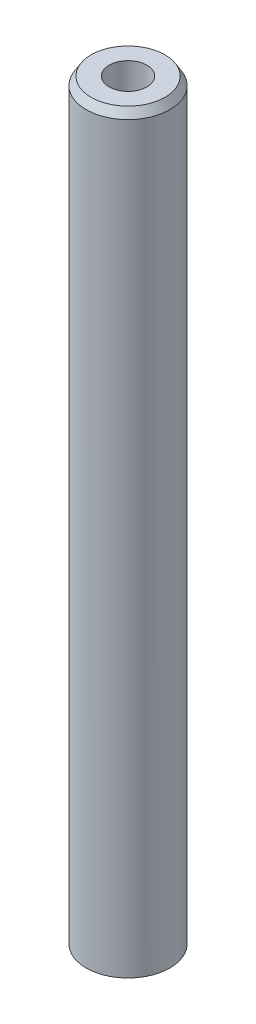
ISO-10303-21;
HEADER;
FILE_DESCRIPTION(('STEP AP214'),'2;1');
FILE_NAME('part.step','',(''),(''),'','','');
FILE_SCHEMA(('AUTOMOTIVE_DESIGN { 1 0 10303 214 1 1 1 1 }'));
ENDSEC;
DATA;
#1=APPLICATION_CONTEXT('core data for automotive mechanical design processes');
#2=APPLICATION_PROTOCOL_DEFINITION('international standard','automotive_design',2000,#1);
#3=PRODUCT_CONTEXT('',#1,'mechanical');
#4=PRODUCT('Part','Part','',(#3));
#5=PRODUCT_RELATED_PRODUCT_CATEGORY('part','',(#4));
#6=PRODUCT_DEFINITION_FORMATION('','',#4);
#7=PRODUCT_DEFINITION_CONTEXT('part definition',#1,'design');
#8=PRODUCT_DEFINITION('design','',#6,#7);
#9=PRODUCT_DEFINITION_SHAPE('','',#8);
#10=(LENGTH_UNIT() NAMED_UNIT(*) SI_UNIT(.MILLI.,.METRE.));
#11=(NAMED_UNIT(*) PLANE_ANGLE_UNIT() SI_UNIT($,.RADIAN.));
#12=(NAMED_UNIT(*) SI_UNIT($,.STERADIAN.) SOLID_ANGLE_UNIT());
#13=UNCERTAINTY_MEASURE_WITH_UNIT(LENGTH_MEASURE(1.E-05),#10,'distance_accuracy_value','');
#14=(GEOMETRIC_REPRESENTATION_CONTEXT(3) GLOBAL_UNCERTAINTY_ASSIGNED_CONTEXT((#13)) GLOBAL_UNIT_ASSIGNED_CONTEXT((#10,
#11,#12)) REPRESENTATION_CONTEXT('',''));
#15=CARTESIAN_POINT('',(0.,0.,0.));
#16=DIRECTION('',(0.,0.,1.));
#17=DIRECTION('',(1.,0.,0.));
#18=AXIS2_PLACEMENT_3D('',#15,#16,#17);
#19=CARTESIAN_POINT('',(0.,361.631506852674,0.));
#20=DIRECTION('',(0.,-1.,0.));
#21=DIRECTION('',(0.,0.,-1.));
#22=AXIS2_PLACEMENT_3D('',#19,#20,#21);
#23=CYLINDRICAL_SURFACE('',#22,20.);
#24=CARTESIAN_POINT('',(0.,357.716211464,0.));
#25=DIRECTION('',(0.,1.,0.));
#26=DIRECTION('',(0.,0.,1.));
#27=AXIS2_PLACEMENT_3D('',#24,#25,#26);
#28=CIRCLE('',#27,20.);
#29=CARTESIAN_POINT('',(0.,357.716211464,-20.));
#30=VERTEX_POINT('',#29);
#31=EDGE_CURVE('E50',#30,#30,#28,.F.);
#32=CARTESIAN_POINT('',(0.,2.37879637390487,0.));
#33=DIRECTION('',(0.,1.,0.));
#34=DIRECTION('',(0.,0.,1.));
#35=AXIS2_PLACEMENT_3D('',#32,#33,#34);
#36=CIRCLE('',#35,20.);
#37=CARTESIAN_POINT('',(0.,2.37879637390487,-20.));
#38=VERTEX_POINT('',#37);
#39=EDGE_CURVE('E51',#38,#38,#36,.T.);
#40=CARTESIAN_POINT('',(0.,357.716211464,-20.));
#41=CARTESIAN_POINT('',(0.,354.014780056811,-20.));
#42=CARTESIAN_POINT('',(0.,350.313348649623,-20.));
#43=CARTESIAN_POINT('',(0.,342.910485835246,-20.));
#44=CARTESIAN_POINT('',(0.,339.209054428058,-20.));
#45=CARTESIAN_POINT('',(0.,331.806191613681,-20.));
#46=CARTESIAN_POINT('',(0.,328.104760206492,-20.));
#47=CARTESIAN_POINT('',(0.,320.701897392115,-20.));
#48=CARTESIAN_POINT('',(0.,317.000465984927,-20.));
#49=CARTESIAN_POINT('',(0.,309.59760317055,-20.));
#50=CARTESIAN_POINT('',(0.,305.896171763361,-20.));
#51=CARTESIAN_POINT('',(0.,298.493308948984,-20.));
#52=CARTESIAN_POINT('',(0.,294.791877541796,-20.));
#53=CARTESIAN_POINT('',(0.,287.389014727419,-20.));
#54=CARTESIAN_POINT('',(0.,283.68758332023,-20.));
#55=CARTESIAN_POINT('',(0.,276.284720505853,-20.));
#56=CARTESIAN_POINT('',(0.,272.583289098665,-20.));
#57=CARTESIAN_POINT('',(0.,265.180426284288,-20.));
#58=CARTESIAN_POINT('',(0.,261.478994877099,-20.));
#59=CARTESIAN_POINT('',(0.,254.076132062722,-20.));
#60=CARTESIAN_POINT('',(0.,250.374700655534,-20.));
#61=CARTESIAN_POINT('',(0.,242.971837841157,-20.));
#62=CARTESIAN_POINT('',(0.,239.270406433968,-20.));
#63=CARTESIAN_POINT('',(0.,231.867543619591,-20.));
#64=CARTESIAN_POINT('',(0.,228.166112212403,-20.));
#65=CARTESIAN_POINT('',(0.,220.763249398026,-20.));
#66=CARTESIAN_POINT('',(0.,217.061817990837,-20.));
#67=CARTESIAN_POINT('',(0.,209.65895517646,-20.));
#68=CARTESIAN_POINT('',(0.,205.957523769272,-20.));
#69=CARTESIAN_POINT('',(0.,198.554660954895,-20.));
#70=CARTESIAN_POINT('',(0.,194.853229547706,-20.));
#71=CARTESIAN_POINT('',(0.,187.450366733329,-20.));
#72=CARTESIAN_POINT('',(0.,183.748935326141,-20.));
#73=CARTESIAN_POINT('',(0.,176.346072511764,-20.));
#74=CARTESIAN_POINT('',(0.,172.644641104575,-20.));
#75=CARTESIAN_POINT('',(0.,165.241778290198,-20.));
#76=CARTESIAN_POINT('',(0.,161.54034688301,-20.));
#77=CARTESIAN_POINT('',(0.,154.137484068633,-20.));
#78=CARTESIAN_POINT('',(0.,150.436052661445,-20.));
#79=CARTESIAN_POINT('',(0.,143.033189847068,-20.));
#80=CARTESIAN_POINT('',(0.,139.331758439879,-20.));
#81=CARTESIAN_POINT('',(0.,131.928895625502,-20.));
#82=CARTESIAN_POINT('',(0.,128.227464218314,-20.));
#83=CARTESIAN_POINT('',(0.,120.824601403937,-20.));
#84=CARTESIAN_POINT('',(0.,117.123169996748,-20.));
#85=CARTESIAN_POINT('',(0.,109.720307182371,-20.));
#86=CARTESIAN_POINT('',(0.,106.018875775183,-20.));
#87=CARTESIAN_POINT('',(0.,98.6160129608056,-20.));
#88=CARTESIAN_POINT('',(0.,94.9145815536172,-20.));
#89=CARTESIAN_POINT('',(0.,87.5117187392402,-20.));
#90=CARTESIAN_POINT('',(0.,83.8102873320517,-20.));
#91=CARTESIAN_POINT('',(0.,76.4074245176747,-20.));
#92=CARTESIAN_POINT('',(0.,72.7059931104862,-20.));
#93=CARTESIAN_POINT('',(0.,65.3031302961092,-20.));
#94=CARTESIAN_POINT('',(0.,61.6016988889207,-20.));
#95=CARTESIAN_POINT('',(0.,54.1988360745437,-20.));
#96=CARTESIAN_POINT('',(0.,50.4974046673552,-20.));
#97=CARTESIAN_POINT('',(0.,43.0945418529783,-20.));
#98=CARTESIAN_POINT('',(0.,39.3931104457898,-20.));
#99=CARTESIAN_POINT('',(0.,31.9902476314128,-20.));
#100=CARTESIAN_POINT('',(0.,28.2888162242243,-20.));
#101=CARTESIAN_POINT('',(0.,20.8859534098473,-20.));
#102=CARTESIAN_POINT('',(0.,17.1845220026588,-20.));
#103=CARTESIAN_POINT('',(0.,9.78165918828183,-20.));
#104=CARTESIAN_POINT('',(0.,6.08022778109335,-20.));
#105=CARTESIAN_POINT('',(0.,2.37879637390487,-20.));
#106=B_SPLINE_CURVE_WITH_KNOTS('',3,(#40,#41,#42,#43,#44,#45,#46,#47,#48,#49,#50,#51,#52,#53,
#54,#55,#56,#57,#58,#59,#60,#61,#62,#63,#64,#65,#66,#67,#68,#69,#70,#71,#72,#73,#74,#75,#76,#77,
#78,#79,#80,#81,#82,#83,#84,#85,#86,#87,#88,#89,#90,#91,#92,#93,#94,#95,#96,#97,#98,#99,#100,
#101,#102,#103,#104,#105),.UNSPECIFIED.,.F.,.F.,(4,2,2,2,2,2,2,2,2,2,2,2,2,2,2,2,2,2,2,2,2,2,2,
2,2,2,2,2,2,2,2,2,4),(0.,11.1042942215654,22.2085884431309,33.3128826646964,44.4171768862618,
55.5214711078273,66.6257653293928,77.7300595509583,88.8343537725237,99.9386479940892,
111.042942215655,122.14723643722,133.251530658786,144.355824880351,155.460119101917,
166.564413323482,177.668707545048,188.773001766613,199.877295988178,210.981590209744,
222.085884431309,233.190178652875,244.29447287444,255.398767096006,266.503061317571,
277.607355539137,288.711649760702,299.815943982268,310.920238203833,322.024532425399,
333.128826646964,344.23312086853,355.337415090095),.UNSPECIFIED.);
#107=EDGE_CURVE('BSEAM39',#30,#38,#106,.T.);
#108=ORIENTED_EDGE('',*,*,#31,.T.);
#109=ORIENTED_EDGE('',*,*,#39,.T.);
#110=ORIENTED_EDGE('',*,*,#107,.T.);
#111=ORIENTED_EDGE('',*,*,#107,.F.);
#112=EDGE_LOOP('',(#108,#110,#109,#111));
#113=FACE_BOUND('',#112,.T.);
#114=ADVANCED_FACE('F39',(#113),#23,.T.);
#115=CARTESIAN_POINT('',(0.,361.631506852674,0.));
#116=DIRECTION('',(0.,1.,0.));
#117=DIRECTION('',(0.,0.,1.));
#118=AXIS2_PLACEMENT_3D('',#115,#116,#117);
#119=PLANE('',#118);
#120=CARTESIAN_POINT('',(0.,361.631506852674,0.));
#121=DIRECTION('',(0.,1.,0.));
#122=DIRECTION('',(0.,0.,1.));
#123=AXIS2_PLACEMENT_3D('',#120,#121,#122);
#124=CIRCLE('',#123,17.6212036260956);
#125=CARTESIAN_POINT('',(0.,361.631506852674,17.6212036260956));
#126=VERTEX_POINT('',#125);
#127=EDGE_CURVE('E54',#126,#126,#124,.T.);
#128=ORIENTED_EDGE('',*,*,#127,.T.);
#129=EDGE_LOOP('',(#128));
#130=FACE_BOUND('',#129,.T.);
#131=CARTESIAN_POINT('',(0.,361.631506852674,0.));
#132=DIRECTION('',(0.,1.,0.));
#133=DIRECTION('',(0.,0.,1.));
#134=AXIS2_PLACEMENT_3D('',#131,#132,#133);
#135=CIRCLE('',#134,9.01482280555022);
#136=CARTESIAN_POINT('',(0.,361.631506852674,-9.01482280555022));
#137=VERTEX_POINT('',#136);
#138=EDGE_CURVE('E58',#137,#137,#135,.T.);
#139=ORIENTED_EDGE('',*,*,#138,.F.);
#140=EDGE_LOOP('',(#139));
#141=FACE_BOUND('',#140,.T.);
#142=ADVANCED_FACE('F69',(#130,#141),#119,.T.);
#143=CARTESIAN_POINT('',(0.,0.,0.));
#144=DIRECTION('',(0.,1.,0.));
#145=DIRECTION('',(0.,0.,1.));
#146=AXIS2_PLACEMENT_3D('',#143,#144,#145);
#147=PLANE('',#146);
#148=CARTESIAN_POINT('',(0.,0.,0.));
#149=DIRECTION('',(0.,1.,0.));
#150=DIRECTION('',(0.,0.,1.));
#151=AXIS2_PLACEMENT_3D('',#148,#149,#150);
#152=CIRCLE('',#151,16.0847046113256);
#153=CARTESIAN_POINT('',(0.,0.,16.0847046113256));
#154=VERTEX_POINT('',#153);
#155=EDGE_CURVE('E10',#154,#154,#152,.F.);
#156=ORIENTED_EDGE('',*,*,#155,.T.);
#157=EDGE_LOOP('',(#156));
#158=FACE_BOUND('',#157,.T.);
#159=CARTESIAN_POINT('',(0.,0.,0.));
#160=DIRECTION('',(0.,1.,0.));
#161=DIRECTION('',(0.,0.,1.));
#162=AXIS2_PLACEMENT_3D('',#159,#160,#161);
#163=CIRCLE('',#162,9.01482280555022);
#164=CARTESIAN_POINT('',(0.,0.,-9.01482280555022));
#165=VERTEX_POINT('',#164);
#166=EDGE_CURVE('E63',#165,#165,#163,.T.);
#167=ORIENTED_EDGE('',*,*,#166,.T.);
#168=EDGE_LOOP('',(#167));
#169=FACE_BOUND('',#168,.T.);
#170=ADVANCED_FACE('F75',(#158,#169),#147,.F.);
#171=CARTESIAN_POINT('',(0.,361.631506852674,0.));
#172=DIRECTION('',(0.,-1.,0.));
#173=DIRECTION('',(0.,0.,-1.));
#174=AXIS2_PLACEMENT_3D('',#171,#172,#173);
#175=CYLINDRICAL_SURFACE('',#174,9.01482280555022);
#176=CARTESIAN_POINT('',(0.,361.631506852674,-9.01482280555022));
#177=CARTESIAN_POINT('',(0.,357.864511989625,-9.01482280555022));
#178=CARTESIAN_POINT('',(0.,354.097517126576,-9.01482280555022));
#179=CARTESIAN_POINT('',(0.,346.563527400479,-9.01482280555022));
#180=CARTESIAN_POINT('',(0.,342.79653253743,-9.01482280555022));
#181=CARTESIAN_POINT('',(0.,335.262542811333,-9.01482280555022));
#182=CARTESIAN_POINT('',(0.,331.495547948284,-9.01482280555022));
#183=CARTESIAN_POINT('',(0.,323.961558222187,-9.01482280555022));
#184=CARTESIAN_POINT('',(0.,320.194563359138,-9.01482280555022));
#185=CARTESIAN_POINT('',(0.,312.660573633041,-9.01482280555022));
#186=CARTESIAN_POINT('',(0.,308.893578769992,-9.01482280555022));
#187=CARTESIAN_POINT('',(0.,301.359589043895,-9.01482280555022));
#188=CARTESIAN_POINT('',(0.,297.592594180846,-9.01482280555022));
#189=CARTESIAN_POINT('',(0.,290.058604454748,-9.01482280555022));
#190=CARTESIAN_POINT('',(0.,286.2916095917,-9.01482280555022));
#191=CARTESIAN_POINT('',(0.,278.757619865602,-9.01482280555022));
#192=CARTESIAN_POINT('',(0.,274.990625002554,-9.01482280555022));
#193=CARTESIAN_POINT('',(0.,267.456635276456,-9.01482280555022));
#194=CARTESIAN_POINT('',(0.,263.689640413408,-9.01482280555022));
#195=CARTESIAN_POINT('',(0.,256.15565068731,-9.01482280555022));
#196=CARTESIAN_POINT('',(0.,252.388655824262,-9.01482280555022));
#197=CARTESIAN_POINT('',(0.,244.854666098164,-9.01482280555022));
#198=CARTESIAN_POINT('',(0.,241.087671235116,-9.01482280555022));
#199=CARTESIAN_POINT('',(0.,233.553681509018,-9.01482280555022));
#200=CARTESIAN_POINT('',(0.,229.78668664597,-9.01482280555022));
#201=CARTESIAN_POINT('',(0.,222.252696919872,-9.01482280555022));
#202=CARTESIAN_POINT('',(0.,218.485702056824,-9.01482280555022));
#203=CARTESIAN_POINT('',(0.,210.951712330726,-9.01482280555022));
#204=CARTESIAN_POINT('',(0.,207.184717467678,-9.01482280555022));
#205=CARTESIAN_POINT('',(0.,199.65072774158,-9.01482280555022));
#206=CARTESIAN_POINT('',(0.,195.883732878531,-9.01482280555022));
#207=CARTESIAN_POINT('',(0.,188.349743152434,-9.01482280555022));
#208=CARTESIAN_POINT('',(0.,184.582748289385,-9.01482280555022));
#209=CARTESIAN_POINT('',(0.,177.048758563288,-9.01482280555022));
#210=CARTESIAN_POINT('',(0.,173.281763700239,-9.01482280555022));
#211=CARTESIAN_POINT('',(0.,165.747773974142,-9.01482280555022));
#212=CARTESIAN_POINT('',(0.,161.980779111093,-9.01482280555022));
#213=CARTESIAN_POINT('',(0.,154.446789384996,-9.01482280555022));
#214=CARTESIAN_POINT('',(0.,150.679794521947,-9.01482280555022));
#215=CARTESIAN_POINT('',(0.,143.14580479585,-9.01482280555022));
#216=CARTESIAN_POINT('',(0.,139.378809932801,-9.01482280555022));
#217=CARTESIAN_POINT('',(0.,131.844820206704,-9.01482280555022));
#218=CARTESIAN_POINT('',(0.,128.077825343655,-9.01482280555022));
#219=CARTESIAN_POINT('',(0.,120.543835617558,-9.01482280555022));
#220=CARTESIAN_POINT('',(0.,116.776840754509,-9.01482280555022));
#221=CARTESIAN_POINT('',(0.,109.242851028412,-9.01482280555022));
#222=CARTESIAN_POINT('',(0.,105.475856165363,-9.01482280555022));
#223=CARTESIAN_POINT('',(0.,97.9418664392657,-9.01482280555022));
#224=CARTESIAN_POINT('',(0.,94.1748715762171,-9.01482280555022));
#225=CARTESIAN_POINT('',(0.,86.6408818501197,-9.01482280555022));
#226=CARTESIAN_POINT('',(0.,82.873886987071,-9.01482280555022));
#227=CARTESIAN_POINT('',(0.,75.3398972609736,-9.01482280555022));
#228=CARTESIAN_POINT('',(0.,71.5729023979249,-9.01482280555022));
#229=CARTESIAN_POINT('',(0.,64.0389126718276,-9.01482280555022));
#230=CARTESIAN_POINT('',(0.,60.2719178087789,-9.01482280555022));
#231=CARTESIAN_POINT('',(0.,52.7379280826815,-9.01482280555022));
#232=CARTESIAN_POINT('',(0.,48.9709332196328,-9.01482280555022));
#233=CARTESIAN_POINT('',(0.,41.4369434935355,-9.01482280555022));
#234=CARTESIAN_POINT('',(0.,37.6699486304868,-9.01482280555022));
#235=CARTESIAN_POINT('',(0.,30.1359589043894,-9.01482280555022));
#236=CARTESIAN_POINT('',(0.,26.3689640413407,-9.01482280555022));
#237=CARTESIAN_POINT('',(0.,18.8349743152434,-9.01482280555022));
#238=CARTESIAN_POINT('',(0.,15.0679794521947,-9.01482280555022));
#239=CARTESIAN_POINT('',(0.,7.53398972609733,-9.01482280555022));
#240=CARTESIAN_POINT('',(0.,3.76699486304864,-9.01482280555022));
#241=CARTESIAN_POINT('',(0.,0.,-9.01482280555022));
#242=B_SPLINE_CURVE_WITH_KNOTS('',3,(#176,#177,#178,#179,#180,#181,#182,#183,#184,#185,#186,
#187,#188,#189,#190,#191,#192,#193,#194,#195,#196,#197,#198,#199,#200,#201,#202,#203,#204,#205,
#206,#207,#208,#209,#210,#211,#212,#213,#214,#215,#216,#217,#218,#219,#220,#221,#222,#223,#224,
#225,#226,#227,#228,#229,#230,#231,#232,#233,#234,#235,#236,#237,#238,#239,#240,#241),
.UNSPECIFIED.,.F.,.F.,(4,2,2,2,2,2,2,2,2,2,2,2,2,2,2,2,2,2,2,2,2,2,2,2,2,2,2,2,2,2,2,2,4),(0.,
11.3009845891461,22.6019691782921,33.9029537674382,45.2039383565842,56.5049229457303,
67.8059075348763,79.1068921240224,90.4078767131684,101.708861302314,113.009845891461,
124.310830480607,135.611815069753,146.912799658899,158.213784248045,169.514768837191,
180.815753426337,192.116738015483,203.417722604629,214.718707193775,226.019691782921,
237.320676372067,248.621660961213,259.922645550359,271.223630139505,282.524614728651,
293.825599317797,305.126583906943,316.427568496089,327.728553085235,339.029537674381,
350.330522263527,361.631506852674),.UNSPECIFIED.);
#243=EDGE_CURVE('BSEAM70',#137,#165,#242,.T.);
#244=ORIENTED_EDGE('',*,*,#138,.T.);
#245=ORIENTED_EDGE('',*,*,#166,.F.);
#246=ORIENTED_EDGE('',*,*,#243,.T.);
#247=ORIENTED_EDGE('',*,*,#243,.F.);
#248=EDGE_LOOP('',(#244,#246,#245,#247));
#249=FACE_BOUND('',#248,.T.);
#250=ADVANCED_FACE('F70',(#249),#175,.F.);
#251=CARTESIAN_POINT('',(0.,361.631506852674,0.));
#252=DIRECTION('',(0.,-1.,0.));
#253=DIRECTION('',(0.,0.,-1.));
#254=AXIS2_PLACEMENT_3D('',#251,#252,#253);
#255=CONICAL_SURFACE('',#254,17.6212036260956,0.545963427526109);
#256=ORIENTED_EDGE('',*,*,#31,.F.);
#257=EDGE_LOOP('',(#256));
#258=FACE_BOUND('',#257,.T.);
#259=ORIENTED_EDGE('',*,*,#127,.F.);
#260=EDGE_LOOP('',(#259));
#261=FACE_BOUND('',#260,.T.);
#262=ADVANCED_FACE('F81',(#258,#261),#255,.T.);
#263=CARTESIAN_POINT('',(0.,2.37879637390487,0.));
#264=DIRECTION('',(0.,1.,0.));
#265=DIRECTION('',(0.,0.,1.));
#266=AXIS2_PLACEMENT_3D('',#263,#264,#265);
#267=CONICAL_SURFACE('',#266,20.,1.0248328992688);
#268=ORIENTED_EDGE('',*,*,#155,.F.);
#269=EDGE_LOOP('',(#268));
#270=FACE_BOUND('',#269,.T.);
#271=ORIENTED_EDGE('',*,*,#39,.F.);
#272=EDGE_LOOP('',(#271));
#273=FACE_BOUND('',#272,.T.);
#274=ADVANCED_FACE('F45',(#270,#273),#267,.T.);
#275=CLOSED_SHELL('',(#114,#142,#170,#250,#262,#274));
#276=MANIFOLD_SOLID_BREP('B2',#275);
#277=ADVANCED_BREP_SHAPE_REPRESENTATION('',(#18,#276),#14);
#278=SHAPE_DEFINITION_REPRESENTATION(#9,#277);
ENDSEC;
END-ISO-10303-21;
